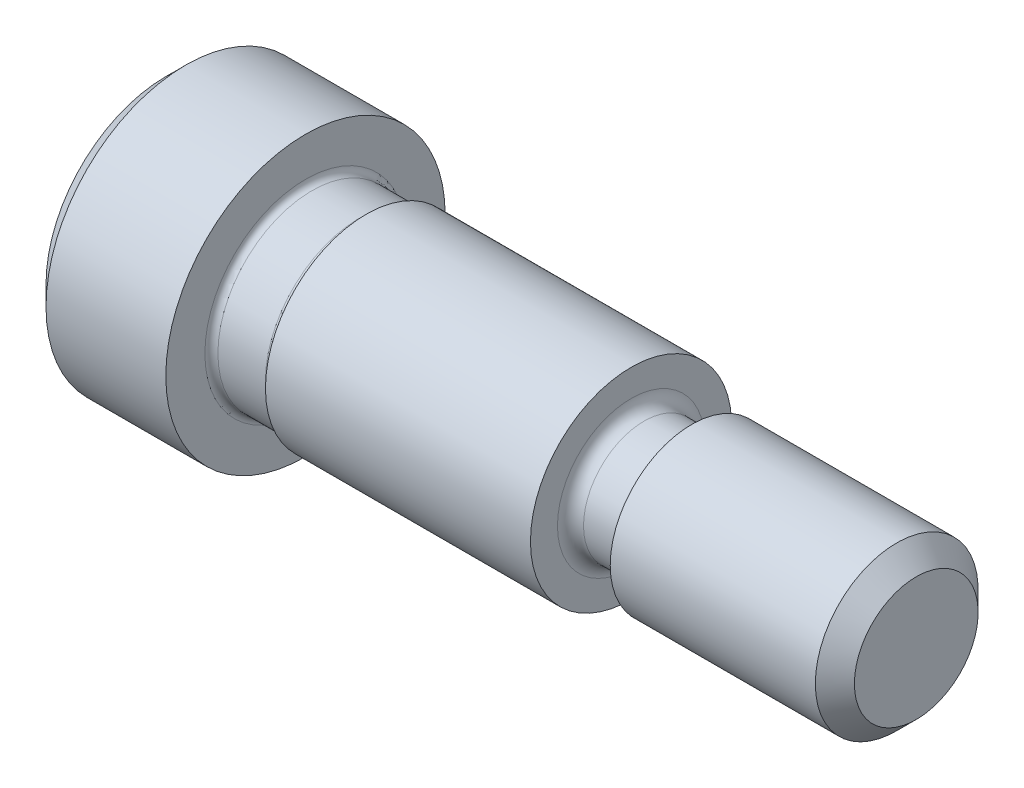
ISO-10303-21;
HEADER;
FILE_DESCRIPTION(('STEP AP214'),'2;1');
FILE_NAME('part.step','',(''),(''),'','','');
FILE_SCHEMA(('AUTOMOTIVE_DESIGN { 1 0 10303 214 1 1 1 1 }'));
ENDSEC;
DATA;
#1=APPLICATION_CONTEXT('core data for automotive mechanical design processes');
#2=APPLICATION_PROTOCOL_DEFINITION('international standard','automotive_design',2000,#1);
#3=PRODUCT_CONTEXT('',#1,'mechanical');
#4=PRODUCT('Part','Part','',(#3));
#5=PRODUCT_RELATED_PRODUCT_CATEGORY('part','',(#4));
#6=PRODUCT_DEFINITION_FORMATION('','',#4);
#7=PRODUCT_DEFINITION_CONTEXT('part definition',#1,'design');
#8=PRODUCT_DEFINITION('design','',#6,#7);
#9=PRODUCT_DEFINITION_SHAPE('','',#8);
#10=(LENGTH_UNIT() NAMED_UNIT(*) SI_UNIT(.MILLI.,.METRE.));
#11=(NAMED_UNIT(*) PLANE_ANGLE_UNIT() SI_UNIT($,.RADIAN.));
#12=(NAMED_UNIT(*) SI_UNIT($,.STERADIAN.) SOLID_ANGLE_UNIT());
#13=UNCERTAINTY_MEASURE_WITH_UNIT(LENGTH_MEASURE(1.E-05),#10,'distance_accuracy_value','');
#14=(GEOMETRIC_REPRESENTATION_CONTEXT(3) GLOBAL_UNCERTAINTY_ASSIGNED_CONTEXT((#13)) GLOBAL_UNIT_ASSIGNED_CONTEXT((#10,
#11,#12)) REPRESENTATION_CONTEXT('',''));
#15=CARTESIAN_POINT('',(0.,0.,0.));
#16=DIRECTION('',(0.,0.,1.));
#17=DIRECTION('',(1.,0.,0.));
#18=AXIS2_PLACEMENT_3D('',#15,#16,#17);
#19=CARTESIAN_POINT('',(26.0236275873131,40.7306383287985,0.));
#20=DIRECTION('',(1.,0.,0.));
#21=DIRECTION('',(0.,0.,-1.));
#22=AXIS2_PLACEMENT_3D('',#19,#20,#21);
#23=CONICAL_SURFACE('',#22,5.44830000000002,0.785398163397462);
#24=CARTESIAN_POINT('',(25.2616275873131,40.7306383287985,0.));
#25=DIRECTION('',(-1.,0.,0.));
#26=DIRECTION('',(0.,0.,1.));
#27=AXIS2_PLACEMENT_3D('',#24,#25,#26);
#28=CIRCLE('',#27,4.68630000000001);
#29=CARTESIAN_POINT('',(25.2616275873131,40.7306383287985,4.68630000000001));
#30=VERTEX_POINT('',#29);
#31=EDGE_CURVE('E81',#30,#30,#28,.T.);
#32=ORIENTED_EDGE('',*,*,#31,.F.);
#33=EDGE_LOOP('',(#32));
#34=FACE_BOUND('',#33,.T.);
#35=CARTESIAN_POINT('',(26.0236275873131,40.7306383287985,0.));
#36=DIRECTION('',(-1.,0.,0.));
#37=DIRECTION('',(0.,0.,1.));
#38=AXIS2_PLACEMENT_3D('',#35,#36,#37);
#39=CIRCLE('',#38,5.44830000000002);
#40=CARTESIAN_POINT('',(26.0236275873131,40.7306383287985,5.44830000000002));
#41=VERTEX_POINT('',#40);
#42=EDGE_CURVE('E10',#41,#41,#39,.T.);
#43=ORIENTED_EDGE('',*,*,#42,.T.);
#44=EDGE_LOOP('',(#43));
#45=FACE_BOUND('',#44,.T.);
#46=ADVANCED_FACE('F32',(#34,#45),#23,.T.);
#47=CARTESIAN_POINT('',(25.2616275873131,40.7306383287985,0.));
#48=DIRECTION('',(-1.,0.,0.));
#49=DIRECTION('',(0.,0.,1.));
#50=AXIS2_PLACEMENT_3D('',#47,#48,#49);
#51=CYLINDRICAL_SURFACE('',#50,5.4483);
#52=ORIENTED_EDGE('',*,*,#42,.F.);
#53=EDGE_LOOP('',(#52));
#54=FACE_BOUND('',#53,.T.);
#55=CARTESIAN_POINT('',(30.6972275873131,40.7306383287985,0.));
#56=DIRECTION('',(-1.,0.,0.));
#57=DIRECTION('',(0.,0.,1.));
#58=AXIS2_PLACEMENT_3D('',#55,#56,#57);
#59=CIRCLE('',#58,5.44829999999999);
#60=CARTESIAN_POINT('',(30.6972275873131,40.7306383287985,5.44829999999999));
#61=VERTEX_POINT('',#60);
#62=EDGE_CURVE('E38',#61,#61,#59,.T.);
#63=ORIENTED_EDGE('',*,*,#62,.T.);
#64=EDGE_LOOP('',(#63));
#65=FACE_BOUND('',#64,.T.);
#66=ADVANCED_FACE('F88',(#54,#65),#51,.T.);
#67=CARTESIAN_POINT('',(30.6972275873131,44.9089383287985,0.));
#68=DIRECTION('',(-1.,0.,0.));
#69=DIRECTION('',(0.,0.,1.));
#70=AXIS2_PLACEMENT_3D('',#67,#68,#69);
#71=PLANE('',#70);
#72=ORIENTED_EDGE('',*,*,#62,.F.);
#73=EDGE_LOOP('',(#72));
#74=FACE_BOUND('',#73,.T.);
#75=CARTESIAN_POINT('',(30.6972275873131,40.7306383287985,0.));
#76=DIRECTION('',(-1.,0.,0.));
#77=DIRECTION('',(0.,0.,1.));
#78=AXIS2_PLACEMENT_3D('',#75,#76,#77);
#79=CIRCLE('',#78,3.92429999999999);
#80=CARTESIAN_POINT('',(30.6972275873131,40.7306383287985,3.92429999999999));
#81=VERTEX_POINT('',#80);
#82=EDGE_CURVE('E42',#81,#81,#79,.T.);
#83=ORIENTED_EDGE('',*,*,#82,.T.);
#84=EDGE_LOOP('',(#83));
#85=FACE_BOUND('',#84,.T.);
#86=ADVANCED_FACE('F92',(#74,#85),#71,.F.);
#87=CARTESIAN_POINT('',(30.9512275873131,40.7306383287985,0.));
#88=DIRECTION('',(-1.,0.,0.));
#89=DIRECTION('',(0.,0.,1.));
#90=AXIS2_PLACEMENT_3D('',#87,#88,#89);
#91=TOROIDAL_SURFACE('',#90,3.92429999999998,0.253999999999999);
#92=ORIENTED_EDGE('',*,*,#82,.F.);
#93=EDGE_LOOP('',(#92));
#94=FACE_BOUND('',#93,.T.);
#95=CARTESIAN_POINT('',(30.9512275873131,40.7306383287985,0.));
#96=DIRECTION('',(-1.,0.,0.));
#97=DIRECTION('',(0.,0.,1.));
#98=AXIS2_PLACEMENT_3D('',#95,#96,#97);
#99=CIRCLE('',#98,3.67029999999999);
#100=CARTESIAN_POINT('',(30.9512275873131,40.7306383287985,3.67029999999999));
#101=VERTEX_POINT('',#100);
#102=EDGE_CURVE('E46',#101,#101,#99,.T.);
#103=ORIENTED_EDGE('',*,*,#102,.T.);
#104=EDGE_LOOP('',(#103));
#105=FACE_BOUND('',#104,.T.);
#106=ADVANCED_FACE('F97',(#94,#105),#91,.F.);
#107=CARTESIAN_POINT('',(25.2616275873131,40.7306383287985,0.));
#108=DIRECTION('',(-1.,0.,0.));
#109=DIRECTION('',(0.,0.,1.));
#110=AXIS2_PLACEMENT_3D('',#107,#108,#109);
#111=CYLINDRICAL_SURFACE('',#110,3.6703);
#112=ORIENTED_EDGE('',*,*,#102,.F.);
#113=EDGE_LOOP('',(#112));
#114=FACE_BOUND('',#113,.T.);
#115=CARTESIAN_POINT('',(32.8054275873131,40.7306383287985,0.));
#116=DIRECTION('',(-1.,0.,0.));
#117=DIRECTION('',(0.,0.,1.));
#118=AXIS2_PLACEMENT_3D('',#115,#116,#117);
#119=CIRCLE('',#118,3.67030000000001);
#120=CARTESIAN_POINT('',(32.8054275873131,40.7306383287985,3.67030000000001));
#121=VERTEX_POINT('',#120);
#122=EDGE_CURVE('E51',#121,#121,#119,.T.);
#123=ORIENTED_EDGE('',*,*,#122,.T.);
#124=EDGE_LOOP('',(#123));
#125=FACE_BOUND('',#124,.T.);
#126=ADVANCED_FACE('F103',(#114,#125),#111,.T.);
#127=CARTESIAN_POINT('',(32.8054275873131,40.7306383287985,0.));
#128=DIRECTION('',(-1.,0.,0.));
#129=DIRECTION('',(0.,0.,1.));
#130=AXIS2_PLACEMENT_3D('',#127,#128,#129);
#131=TOROIDAL_SURFACE('',#130,3.9243,0.25399999999999);
#132=ORIENTED_EDGE('',*,*,#122,.F.);
#133=EDGE_LOOP('',(#132));
#134=FACE_BOUND('',#133,.T.);
#135=CARTESIAN_POINT('',(33.0594275873131,40.7306383287985,0.));
#136=DIRECTION('',(-1.,0.,0.));
#137=DIRECTION('',(0.,0.,1.));
#138=AXIS2_PLACEMENT_3D('',#135,#136,#137);
#139=CIRCLE('',#138,3.92429999999998);
#140=CARTESIAN_POINT('',(33.0594275873131,40.7306383287985,3.92429999999998));
#141=VERTEX_POINT('',#140);
#142=EDGE_CURVE('E54',#141,#141,#139,.T.);
#143=ORIENTED_EDGE('',*,*,#142,.T.);
#144=EDGE_LOOP('',(#143));
#145=FACE_BOUND('',#144,.T.);
#146=ADVANCED_FACE('F107',(#134,#145),#131,.F.);
#147=CARTESIAN_POINT('',(25.2616275873131,40.7306383287985,0.));
#148=DIRECTION('',(-1.,0.,0.));
#149=DIRECTION('',(0.,0.,1.));
#150=AXIS2_PLACEMENT_3D('',#147,#148,#149);
#151=CYLINDRICAL_SURFACE('',#150,3.92429999999998);
#152=ORIENTED_EDGE('',*,*,#142,.F.);
#153=EDGE_LOOP('',(#152));
#154=FACE_BOUND('',#153,.T.);
#155=CARTESIAN_POINT('',(43.3972275873131,40.7306383287985,0.));
#156=DIRECTION('',(-1.,0.,0.));
#157=DIRECTION('',(0.,0.,1.));
#158=AXIS2_PLACEMENT_3D('',#155,#156,#157);
#159=CIRCLE('',#158,3.92429999999998);
#160=CARTESIAN_POINT('',(43.3972275873131,40.7306383287985,3.92429999999998));
#161=VERTEX_POINT('',#160);
#162=EDGE_CURVE('E57',#161,#161,#159,.T.);
#163=ORIENTED_EDGE('',*,*,#162,.T.);
#164=EDGE_LOOP('',(#163));
#165=FACE_BOUND('',#164,.T.);
#166=ADVANCED_FACE('F111',(#154,#165),#151,.T.);
#167=CARTESIAN_POINT('',(43.3972275873131,44.6549383287985,0.));
#168=DIRECTION('',(-1.,0.,0.));
#169=DIRECTION('',(0.,0.,1.));
#170=AXIS2_PLACEMENT_3D('',#167,#168,#169);
#171=PLANE('',#170);
#172=ORIENTED_EDGE('',*,*,#162,.F.);
#173=EDGE_LOOP('',(#172));
#174=FACE_BOUND('',#173,.T.);
#175=CARTESIAN_POINT('',(43.3972275873131,40.7306383287985,0.));
#176=DIRECTION('',(-1.,0.,0.));
#177=DIRECTION('',(0.,0.,1.));
#178=AXIS2_PLACEMENT_3D('',#175,#176,#177);
#179=CIRCLE('',#178,2.87019999999998);
#180=CARTESIAN_POINT('',(43.3972275873131,40.7306383287985,2.87019999999998));
#181=VERTEX_POINT('',#180);
#182=EDGE_CURVE('E60',#181,#181,#179,.T.);
#183=ORIENTED_EDGE('',*,*,#182,.T.);
#184=EDGE_LOOP('',(#183));
#185=FACE_BOUND('',#184,.T.);
#186=ADVANCED_FACE('F115',(#174,#185),#171,.F.);
#187=CARTESIAN_POINT('',(43.9052275873131,40.7306383287985,0.));
#188=DIRECTION('',(-1.,0.,0.));
#189=DIRECTION('',(0.,0.,1.));
#190=AXIS2_PLACEMENT_3D('',#187,#188,#189);
#191=TOROIDAL_SURFACE('',#190,2.87019999999998,0.507999999999988);
#192=ORIENTED_EDGE('',*,*,#182,.F.);
#193=EDGE_LOOP('',(#192));
#194=FACE_BOUND('',#193,.T.);
#195=CARTESIAN_POINT('',(43.9052275873131,40.7306383287985,0.));
#196=DIRECTION('',(-1.,0.,0.));
#197=DIRECTION('',(0.,0.,1.));
#198=AXIS2_PLACEMENT_3D('',#195,#196,#197);
#199=CIRCLE('',#198,2.36219999999999);
#200=CARTESIAN_POINT('',(43.9052275873131,40.7306383287985,2.36219999999999));
#201=VERTEX_POINT('',#200);
#202=EDGE_CURVE('E63',#201,#201,#199,.T.);
#203=ORIENTED_EDGE('',*,*,#202,.T.);
#204=EDGE_LOOP('',(#203));
#205=FACE_BOUND('',#204,.T.);
#206=ADVANCED_FACE('F119',(#194,#205),#191,.F.);
#207=CARTESIAN_POINT('',(25.2616275873131,40.7306383287985,0.));
#208=DIRECTION('',(-1.,0.,0.));
#209=DIRECTION('',(0.,0.,1.));
#210=AXIS2_PLACEMENT_3D('',#207,#208,#209);
#211=CYLINDRICAL_SURFACE('',#210,2.36219999999999);
#212=ORIENTED_EDGE('',*,*,#202,.F.);
#213=EDGE_LOOP('',(#212));
#214=FACE_BOUND('',#213,.T.);
#215=CARTESIAN_POINT('',(45.5054275873132,40.7306383287985,0.));
#216=DIRECTION('',(-1.,0.,0.));
#217=DIRECTION('',(0.,0.,1.));
#218=AXIS2_PLACEMENT_3D('',#215,#216,#217);
#219=CIRCLE('',#218,2.36219999999999);
#220=CARTESIAN_POINT('',(45.5054275873132,40.7306383287985,2.36219999999999));
#221=VERTEX_POINT('',#220);
#222=EDGE_CURVE('E66',#221,#221,#219,.T.);
#223=ORIENTED_EDGE('',*,*,#222,.T.);
#224=EDGE_LOOP('',(#223));
#225=FACE_BOUND('',#224,.T.);
#226=ADVANCED_FACE('F123',(#214,#225),#211,.T.);
#227=CARTESIAN_POINT('',(45.5054275873132,40.7306383287985,0.));
#228=DIRECTION('',(-1.,0.,0.));
#229=DIRECTION('',(0.,0.,1.));
#230=AXIS2_PLACEMENT_3D('',#227,#228,#229);
#231=TOROIDAL_SURFACE('',#230,2.61619999999998,0.253999999999994);
#232=ORIENTED_EDGE('',*,*,#222,.F.);
#233=EDGE_LOOP('',(#232));
#234=FACE_BOUND('',#233,.T.);
#235=CARTESIAN_POINT('',(45.7594275873131,40.7306383287985,0.));
#236=DIRECTION('',(-1.,0.,0.));
#237=DIRECTION('',(0.,0.,1.));
#238=AXIS2_PLACEMENT_3D('',#235,#236,#237);
#239=CIRCLE('',#238,2.61620000000001);
#240=CARTESIAN_POINT('',(45.7594275873131,40.7306383287985,2.61620000000001));
#241=VERTEX_POINT('',#240);
#242=EDGE_CURVE('E69',#241,#241,#239,.T.);
#243=ORIENTED_EDGE('',*,*,#242,.T.);
#244=EDGE_LOOP('',(#243));
#245=FACE_BOUND('',#244,.T.);
#246=ADVANCED_FACE('F127',(#234,#245),#231,.F.);
#247=CARTESIAN_POINT('',(45.7594275873131,43.9056383287985,0.));
#248=DIRECTION('',(1.,0.,0.));
#249=DIRECTION('',(0.,0.,-1.));
#250=AXIS2_PLACEMENT_3D('',#247,#248,#249);
#251=PLANE('',#250);
#252=ORIENTED_EDGE('',*,*,#242,.F.);
#253=EDGE_LOOP('',(#252));
#254=FACE_BOUND('',#253,.T.);
#255=CARTESIAN_POINT('',(45.7594275873131,40.7306383287985,0.));
#256=DIRECTION('',(-1.,0.,0.));
#257=DIRECTION('',(0.,0.,1.));
#258=AXIS2_PLACEMENT_3D('',#255,#256,#257);
#259=CIRCLE('',#258,3.17500000000001);
#260=CARTESIAN_POINT('',(45.7594275873131,40.7306383287985,3.17500000000001));
#261=VERTEX_POINT('',#260);
#262=EDGE_CURVE('E72',#261,#261,#259,.T.);
#263=ORIENTED_EDGE('',*,*,#262,.T.);
#264=EDGE_LOOP('',(#263));
#265=FACE_BOUND('',#264,.T.);
#266=ADVANCED_FACE('F131',(#254,#265),#251,.F.);
#267=CARTESIAN_POINT('',(25.2616275873131,40.7306383287985,0.));
#268=DIRECTION('',(-1.,0.,0.));
#269=DIRECTION('',(0.,0.,1.));
#270=AXIS2_PLACEMENT_3D('',#267,#268,#269);
#271=CYLINDRICAL_SURFACE('',#270,3.17500000000001);
#272=ORIENTED_EDGE('',*,*,#262,.F.);
#273=EDGE_LOOP('',(#272));
#274=FACE_BOUND('',#273,.T.);
#275=CARTESIAN_POINT('',(53.7604275873131,40.7306383287985,0.));
#276=DIRECTION('',(-1.,0.,0.));
#277=DIRECTION('',(0.,0.,1.));
#278=AXIS2_PLACEMENT_3D('',#275,#276,#277);
#279=CIRCLE('',#278,3.17500000000001);
#280=CARTESIAN_POINT('',(53.7604275873131,40.7306383287985,3.17500000000001));
#281=VERTEX_POINT('',#280);
#282=EDGE_CURVE('E75',#281,#281,#279,.T.);
#283=ORIENTED_EDGE('',*,*,#282,.T.);
#284=EDGE_LOOP('',(#283));
#285=FACE_BOUND('',#284,.T.);
#286=ADVANCED_FACE('F135',(#274,#285),#271,.T.);
#287=CARTESIAN_POINT('',(54.5224275873131,40.7306383287985,0.));
#288=DIRECTION('',(-1.,0.,0.));
#289=DIRECTION('',(0.,0.,1.));
#290=AXIS2_PLACEMENT_3D('',#287,#288,#289);
#291=CONICAL_SURFACE('',#290,2.41300000000001,0.785398163397462);
#292=ORIENTED_EDGE('',*,*,#282,.F.);
#293=EDGE_LOOP('',(#292));
#294=FACE_BOUND('',#293,.T.);
#295=CARTESIAN_POINT('',(54.5224275873131,40.7306383287985,0.));
#296=DIRECTION('',(-1.,0.,0.));
#297=DIRECTION('',(0.,0.,1.));
#298=AXIS2_PLACEMENT_3D('',#295,#296,#297);
#299=CIRCLE('',#298,2.41300000000001);
#300=CARTESIAN_POINT('',(54.5224275873131,40.7306383287985,2.41300000000001));
#301=VERTEX_POINT('',#300);
#302=EDGE_CURVE('E78',#301,#301,#299,.T.);
#303=ORIENTED_EDGE('',*,*,#302,.T.);
#304=EDGE_LOOP('',(#303));
#305=FACE_BOUND('',#304,.T.);
#306=ADVANCED_FACE('F139',(#294,#305),#291,.T.);
#307=CARTESIAN_POINT('',(54.5224275873131,43.1436383287985,0.));
#308=DIRECTION('',(-1.,0.,0.));
#309=DIRECTION('',(0.,0.,1.));
#310=AXIS2_PLACEMENT_3D('',#307,#308,#309);
#311=PLANE('',#310);
#312=ORIENTED_EDGE('',*,*,#302,.F.);
#313=EDGE_LOOP('',(#312));
#314=FACE_BOUND('',#313,.T.);
#315=ADVANCED_FACE('F143',(#314),#311,.F.);
#316=CARTESIAN_POINT('',(25.2616275873131,45.4169383287985,0.));
#317=DIRECTION('',(1.,0.,0.));
#318=DIRECTION('',(0.,0.,-1.));
#319=AXIS2_PLACEMENT_3D('',#316,#317,#318);
#320=PLANE('',#319);
#321=ORIENTED_EDGE('',*,*,#31,.T.);
#322=EDGE_LOOP('',(#321));
#323=FACE_BOUND('',#322,.T.);
#324=ADVANCED_FACE('F85',(#323),#320,.F.);
#325=CLOSED_SHELL('',(#46,#66,#86,#106,#126,#146,#166,#186,#206,#226,#246,#266,#286,#306,#315,#324));
#326=MANIFOLD_SOLID_BREP('B2',#325);
#327=ADVANCED_BREP_SHAPE_REPRESENTATION('',(#18,#326),#14);
#328=SHAPE_DEFINITION_REPRESENTATION(#9,#327);
ENDSEC;
END-ISO-10303-21;
